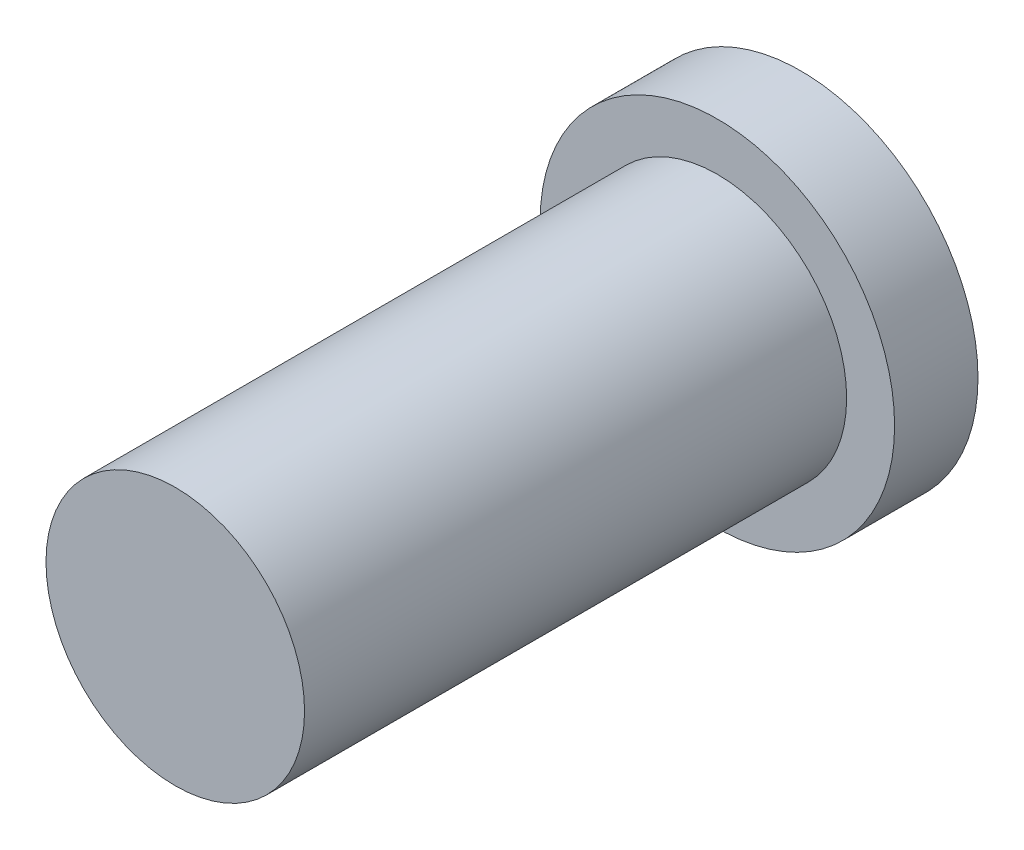
ISO-10303-21;
HEADER;
FILE_DESCRIPTION(('STEP AP214'),'2;1');
FILE_NAME('part.step','',(''),(''),'','','');
FILE_SCHEMA(('AUTOMOTIVE_DESIGN { 1 0 10303 214 1 1 1 1 }'));
ENDSEC;
DATA;
#1=APPLICATION_CONTEXT('core data for automotive mechanical design processes');
#2=APPLICATION_PROTOCOL_DEFINITION('international standard','automotive_design',2000,#1);
#3=PRODUCT_CONTEXT('',#1,'mechanical');
#4=PRODUCT('Part','Part','',(#3));
#5=PRODUCT_RELATED_PRODUCT_CATEGORY('part','',(#4));
#6=PRODUCT_DEFINITION_FORMATION('','',#4);
#7=PRODUCT_DEFINITION_CONTEXT('part definition',#1,'design');
#8=PRODUCT_DEFINITION('design','',#6,#7);
#9=PRODUCT_DEFINITION_SHAPE('','',#8);
#10=(LENGTH_UNIT() NAMED_UNIT(*) SI_UNIT(.MILLI.,.METRE.));
#11=(NAMED_UNIT(*) PLANE_ANGLE_UNIT() SI_UNIT($,.RADIAN.));
#12=(NAMED_UNIT(*) SI_UNIT($,.STERADIAN.) SOLID_ANGLE_UNIT());
#13=UNCERTAINTY_MEASURE_WITH_UNIT(LENGTH_MEASURE(1.E-05),#10,'distance_accuracy_value','');
#14=(GEOMETRIC_REPRESENTATION_CONTEXT(3) GLOBAL_UNCERTAINTY_ASSIGNED_CONTEXT((#13)) GLOBAL_UNIT_ASSIGNED_CONTEXT((#10,
#11,#12)) REPRESENTATION_CONTEXT('',''));
#15=CARTESIAN_POINT('',(0.,0.,0.));
#16=DIRECTION('',(0.,0.,1.));
#17=DIRECTION('',(1.,0.,0.));
#18=AXIS2_PLACEMENT_3D('',#15,#16,#17);
#19=CARTESIAN_POINT('',(0.,0.,2.54));
#20=DIRECTION('',(0.,0.,-1.));
#21=DIRECTION('',(-1.,0.,0.));
#22=AXIS2_PLACEMENT_3D('',#19,#20,#21);
#23=CYLINDRICAL_SURFACE('',#22,5.3975);
#24=CARTESIAN_POINT('',(0.,0.,2.54));
#25=DIRECTION('',(0.,0.,1.));
#26=DIRECTION('',(1.,0.,0.));
#27=AXIS2_PLACEMENT_3D('',#24,#25,#26);
#28=CIRCLE('',#27,5.3975);
#29=CARTESIAN_POINT('',(5.3975,0.,2.54));
#30=VERTEX_POINT('',#29);
#31=EDGE_CURVE('E40',#30,#30,#28,.T.);
#32=ORIENTED_EDGE('',*,*,#31,.F.);
#33=EDGE_LOOP('',(#32));
#34=FACE_BOUND('',#33,.T.);
#35=CARTESIAN_POINT('',(0.,0.,0.));
#36=DIRECTION('',(0.,0.,1.));
#37=DIRECTION('',(1.,0.,0.));
#38=AXIS2_PLACEMENT_3D('',#35,#36,#37);
#39=CIRCLE('',#38,5.3975);
#40=CARTESIAN_POINT('',(5.3975,0.,0.));
#41=VERTEX_POINT('',#40);
#42=EDGE_CURVE('E36',#41,#41,#39,.T.);
#43=ORIENTED_EDGE('',*,*,#42,.T.);
#44=EDGE_LOOP('',(#43));
#45=FACE_BOUND('',#44,.T.);
#46=ADVANCED_FACE('F33',(#34,#45),#23,.T.);
#47=CARTESIAN_POINT('',(0.,0.,2.54));
#48=DIRECTION('',(0.,0.,1.));
#49=DIRECTION('',(1.,0.,0.));
#50=AXIS2_PLACEMENT_3D('',#47,#48,#49);
#51=PLANE('',#50);
#52=CARTESIAN_POINT('',(0.,0.,2.54));
#53=DIRECTION('',(0.,0.,1.));
#54=DIRECTION('',(1.,0.,0.));
#55=AXIS2_PLACEMENT_3D('',#52,#53,#54);
#56=CIRCLE('',#55,3.937);
#57=CARTESIAN_POINT('',(3.937,0.,2.54));
#58=VERTEX_POINT('',#57);
#59=EDGE_CURVE('E10',#58,#58,#56,.T.);
#60=ORIENTED_EDGE('',*,*,#59,.F.);
#61=EDGE_LOOP('',(#60));
#62=FACE_BOUND('',#61,.T.);
#63=ORIENTED_EDGE('',*,*,#31,.T.);
#64=EDGE_LOOP('',(#63));
#65=FACE_BOUND('',#64,.T.);
#66=ADVANCED_FACE('F57',(#62,#65),#51,.T.);
#67=CARTESIAN_POINT('',(0.,0.,0.));
#68=DIRECTION('',(0.,0.,1.));
#69=DIRECTION('',(1.,0.,0.));
#70=AXIS2_PLACEMENT_3D('',#67,#68,#69);
#71=PLANE('',#70);
#72=ORIENTED_EDGE('',*,*,#42,.F.);
#73=EDGE_LOOP('',(#72));
#74=FACE_BOUND('',#73,.T.);
#75=ADVANCED_FACE('F54',(#74),#71,.F.);
#76=CARTESIAN_POINT('',(0.,0.,19.05));
#77=DIRECTION('',(0.,0.,-1.));
#78=DIRECTION('',(-1.,0.,0.));
#79=AXIS2_PLACEMENT_3D('',#76,#77,#78);
#80=CYLINDRICAL_SURFACE('',#79,3.937);
#81=CARTESIAN_POINT('',(0.,0.,19.05));
#82=DIRECTION('',(0.,0.,1.));
#83=DIRECTION('',(1.,0.,0.));
#84=AXIS2_PLACEMENT_3D('',#81,#82,#83);
#85=CIRCLE('',#84,3.937);
#86=CARTESIAN_POINT('',(3.937,0.,19.05));
#87=VERTEX_POINT('',#86);
#88=EDGE_CURVE('E46',#87,#87,#85,.T.);
#89=ORIENTED_EDGE('',*,*,#88,.F.);
#90=EDGE_LOOP('',(#89));
#91=FACE_BOUND('',#90,.T.);
#92=ORIENTED_EDGE('',*,*,#59,.T.);
#93=EDGE_LOOP('',(#92));
#94=FACE_BOUND('',#93,.T.);
#95=ADVANCED_FACE('F56',(#91,#94),#80,.T.);
#96=CARTESIAN_POINT('',(0.,0.,19.05));
#97=DIRECTION('',(0.,0.,1.));
#98=DIRECTION('',(1.,0.,0.));
#99=AXIS2_PLACEMENT_3D('',#96,#97,#98);
#100=PLANE('',#99);
#101=ORIENTED_EDGE('',*,*,#88,.T.);
#102=EDGE_LOOP('',(#101));
#103=FACE_BOUND('',#102,.T.);
#104=ADVANCED_FACE('F62',(#103),#100,.T.);
#105=CLOSED_SHELL('',(#46,#66,#75,#95,#104));
#106=MANIFOLD_SOLID_BREP('B2',#105);
#107=ADVANCED_BREP_SHAPE_REPRESENTATION('',(#18,#106),#14);
#108=SHAPE_DEFINITION_REPRESENTATION(#9,#107);
ENDSEC;
END-ISO-10303-21;
